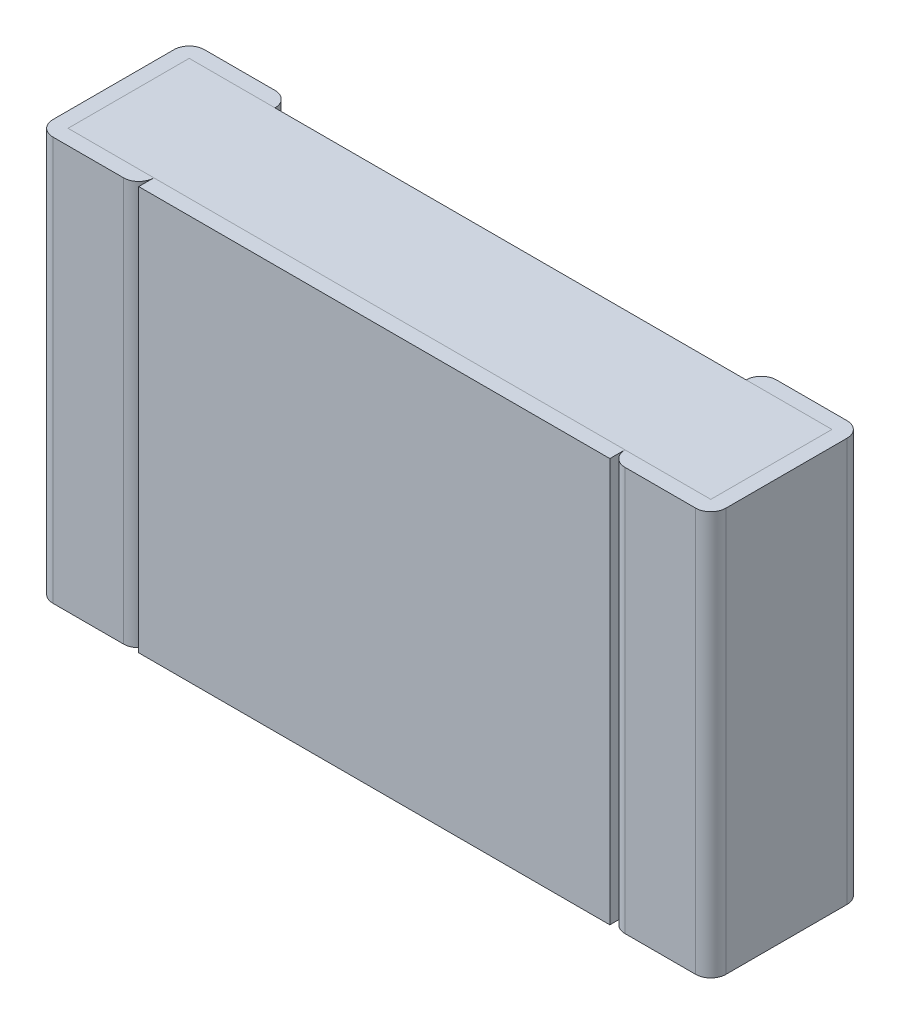
ISO-10303-21;
HEADER;
FILE_DESCRIPTION(('STEP AP214'),'2;1');
FILE_NAME('part.step','',(''),(''),'','','');
FILE_SCHEMA(('AUTOMOTIVE_DESIGN { 1 0 10303 214 1 1 1 1 }'));
ENDSEC;
DATA;
#1=APPLICATION_CONTEXT('core data for automotive mechanical design processes');
#2=APPLICATION_PROTOCOL_DEFINITION('international standard','automotive_design',2000,#1);
#3=PRODUCT_CONTEXT('',#1,'mechanical');
#4=PRODUCT('Part','Part','',(#3));
#5=PRODUCT_RELATED_PRODUCT_CATEGORY('part','',(#4));
#6=PRODUCT_DEFINITION_FORMATION('','',#4);
#7=PRODUCT_DEFINITION_CONTEXT('part definition',#1,'design');
#8=PRODUCT_DEFINITION('design','',#6,#7);
#9=PRODUCT_DEFINITION_SHAPE('','',#8);
#10=(LENGTH_UNIT() NAMED_UNIT(*) SI_UNIT(.MILLI.,.METRE.));
#11=(NAMED_UNIT(*) PLANE_ANGLE_UNIT() SI_UNIT($,.RADIAN.));
#12=(NAMED_UNIT(*) SI_UNIT($,.STERADIAN.) SOLID_ANGLE_UNIT());
#13=UNCERTAINTY_MEASURE_WITH_UNIT(LENGTH_MEASURE(1.E-05),#10,'distance_accuracy_value','');
#14=(GEOMETRIC_REPRESENTATION_CONTEXT(3) GLOBAL_UNCERTAINTY_ASSIGNED_CONTEXT((#13)) GLOBAL_UNIT_ASSIGNED_CONTEXT((#10,
#11,#12)) REPRESENTATION_CONTEXT('',''));
#15=CARTESIAN_POINT('',(0.,0.,0.));
#16=DIRECTION('',(0.,0.,1.));
#17=DIRECTION('',(1.,0.,0.));
#18=AXIS2_PLACEMENT_3D('',#15,#16,#17);
#19=CARTESIAN_POINT('',(-0.7,-0.6,0.45));
#20=DIRECTION('',(0.,0.,1.));
#21=DIRECTION('',(1.,0.,0.));
#22=AXIS2_PLACEMENT_3D('',#19,#20,#21);
#23=PLANE('',#22);
#24=DIRECTION('',(0.,1.,0.));
#25=VECTOR('',#24,1.);
#26=CARTESIAN_POINT('',(-0.7,-0.6,0.45));
#27=LINE('',#26,#25);
#28=CARTESIAN_POINT('',(-0.7,-0.6,0.45));
#29=VERTEX_POINT('',#28);
#30=CARTESIAN_POINT('',(-0.7,0.6,0.45));
#31=VERTEX_POINT('',#30);
#32=EDGE_CURVE('E374',#29,#31,#27,.T.);
#33=ORIENTED_EDGE('',*,*,#32,.F.);
#34=DIRECTION('',(1.,0.,0.));
#35=VECTOR('',#34,1.);
#36=CARTESIAN_POINT('',(-0.7,-0.6,0.45));
#37=LINE('',#36,#35);
#38=CARTESIAN_POINT('',(0.7,-0.6,0.45));
#39=VERTEX_POINT('',#38);
#40=EDGE_CURVE('E347',#29,#39,#37,.T.);
#41=ORIENTED_EDGE('',*,*,#40,.T.);
#42=DIRECTION('',(0.,1.,0.));
#43=VECTOR('',#42,1.);
#44=CARTESIAN_POINT('',(0.7,-0.6,0.45));
#45=LINE('',#44,#43);
#46=CARTESIAN_POINT('',(0.7,0.6,0.45));
#47=VERTEX_POINT('',#46);
#48=EDGE_CURVE('E11',#39,#47,#45,.T.);
#49=ORIENTED_EDGE('',*,*,#48,.T.);
#50=DIRECTION('',(1.,0.,0.));
#51=VECTOR('',#50,1.);
#52=CARTESIAN_POINT('',(-0.7,0.6,0.45));
#53=LINE('',#52,#51);
#54=EDGE_CURVE('E454',#31,#47,#53,.T.);
#55=ORIENTED_EDGE('',*,*,#54,.F.);
#56=EDGE_LOOP('',(#33,#41,#49,#55));
#57=FACE_BOUND('',#56,.T.);
#58=ADVANCED_FACE('F17',(#57),#23,.T.);
#59=CARTESIAN_POINT('',(0.7,-0.6,0.405));
#60=DIRECTION('',(1.,0.,0.));
#61=DIRECTION('',(0.,1.,0.));
#62=AXIS2_PLACEMENT_3D('',#59,#60,#61);
#63=PLANE('',#62);
#64=DIRECTION('',(0.,0.,1.));
#65=VECTOR('',#64,1.);
#66=CARTESIAN_POINT('',(0.7,-0.6,0.405));
#67=LINE('',#66,#65);
#68=CARTESIAN_POINT('',(0.7,-0.6,0.405));
#69=VERTEX_POINT('',#68);
#70=EDGE_CURVE('E236',#69,#39,#67,.T.);
#71=ORIENTED_EDGE('',*,*,#70,.F.);
#72=DIRECTION('',(0.,1.,0.));
#73=VECTOR('',#72,1.);
#74=CARTESIAN_POINT('',(0.7,-0.6,0.405));
#75=LINE('',#74,#73);
#76=CARTESIAN_POINT('',(0.7,0.6,0.405));
#77=VERTEX_POINT('',#76);
#78=EDGE_CURVE('E25',#69,#77,#75,.T.);
#79=ORIENTED_EDGE('',*,*,#78,.T.);
#80=DIRECTION('',(0.,0.,1.));
#81=VECTOR('',#80,1.);
#82=CARTESIAN_POINT('',(0.7,0.6,0.405));
#83=LINE('',#82,#81);
#84=EDGE_CURVE('E227',#77,#47,#83,.T.);
#85=ORIENTED_EDGE('',*,*,#84,.T.);
#86=ORIENTED_EDGE('',*,*,#48,.F.);
#87=EDGE_LOOP('',(#71,#79,#85,#86));
#88=FACE_BOUND('',#87,.T.);
#89=ADVANCED_FACE('F477',(#88),#63,.T.);
#90=CARTESIAN_POINT('',(0.745,-0.6,0.405));
#91=DIRECTION('',(0.,1.,0.));
#92=DIRECTION('',(-1.,0.,0.));
#93=AXIS2_PLACEMENT_3D('',#90,#91,#92);
#94=CYLINDRICAL_SURFACE('',#93,0.045);
#95=CARTESIAN_POINT('',(0.745,-0.6,0.405));
#96=DIRECTION('',(0.,1.,0.));
#97=DIRECTION('',(0.,0.,1.));
#98=AXIS2_PLACEMENT_3D('',#95,#96,#97);
#99=CIRCLE('',#98,0.045);
#100=CARTESIAN_POINT('',(0.745,-0.6,0.45));
#101=VERTEX_POINT('',#100);
#102=EDGE_CURVE('E244',#69,#101,#99,.T.);
#103=ORIENTED_EDGE('',*,*,#102,.T.);
#104=DIRECTION('',(0.,1.,0.));
#105=VECTOR('',#104,1.);
#106=CARTESIAN_POINT('',(0.745,-0.6,0.45));
#107=LINE('',#106,#105);
#108=CARTESIAN_POINT('',(0.745,0.6,0.45));
#109=VERTEX_POINT('',#108);
#110=EDGE_CURVE('E470',#101,#109,#107,.T.);
#111=ORIENTED_EDGE('',*,*,#110,.T.);
#112=CARTESIAN_POINT('',(0.745,0.6,0.405));
#113=DIRECTION('',(0.,1.,0.));
#114=DIRECTION('',(0.,0.,1.));
#115=AXIS2_PLACEMENT_3D('',#112,#113,#114);
#116=CIRCLE('',#115,0.045);
#117=EDGE_CURVE('E364',#77,#109,#116,.T.);
#118=ORIENTED_EDGE('',*,*,#117,.F.);
#119=ORIENTED_EDGE('',*,*,#78,.F.);
#120=EDGE_LOOP('',(#103,#111,#118,#119));
#121=FACE_BOUND('',#120,.T.);
#122=ADVANCED_FACE('F485',(#121),#94,.T.);
#123=CARTESIAN_POINT('',(0.7,-0.6,0.45));
#124=DIRECTION('',(0.,0.,1.));
#125=DIRECTION('',(1.,0.,0.));
#126=AXIS2_PLACEMENT_3D('',#123,#124,#125);
#127=PLANE('',#126);
#128=DIRECTION('',(1.,0.,0.));
#129=VECTOR('',#128,1.);
#130=CARTESIAN_POINT('',(0.7,0.6,0.45));
#131=LINE('',#130,#129);
#132=CARTESIAN_POINT('',(0.955,0.6,0.45));
#133=VERTEX_POINT('',#132);
#134=EDGE_CURVE('E359',#109,#133,#131,.T.);
#135=ORIENTED_EDGE('',*,*,#134,.F.);
#136=ORIENTED_EDGE('',*,*,#110,.F.);
#137=DIRECTION('',(1.,0.,0.));
#138=VECTOR('',#137,1.);
#139=CARTESIAN_POINT('',(0.7,-0.6,0.45));
#140=LINE('',#139,#138);
#141=CARTESIAN_POINT('',(0.955,-0.6,0.45));
#142=VERTEX_POINT('',#141);
#143=EDGE_CURVE('E250',#101,#142,#140,.T.);
#144=ORIENTED_EDGE('',*,*,#143,.T.);
#145=DIRECTION('',(0.,1.,0.));
#146=VECTOR('',#145,1.);
#147=CARTESIAN_POINT('',(0.955,-0.6,0.45));
#148=LINE('',#147,#146);
#149=EDGE_CURVE('E467',#142,#133,#148,.T.);
#150=ORIENTED_EDGE('',*,*,#149,.T.);
#151=EDGE_LOOP('',(#135,#136,#144,#150));
#152=FACE_BOUND('',#151,.T.);
#153=ADVANCED_FACE('F520',(#152),#127,.T.);
#154=CARTESIAN_POINT('',(0.955,-0.6,0.405));
#155=DIRECTION('',(0.,1.,0.));
#156=DIRECTION('',(1.,0.,0.));
#157=AXIS2_PLACEMENT_3D('',#154,#155,#156);
#158=CYLINDRICAL_SURFACE('',#157,0.045);
#159=DIRECTION('',(0.,1.,0.));
#160=VECTOR('',#159,1.);
#161=CARTESIAN_POINT('',(1.,-0.6,0.405));
#162=LINE('',#161,#160);
#163=CARTESIAN_POINT('',(1.,-0.6,0.405));
#164=VERTEX_POINT('',#163);
#165=CARTESIAN_POINT('',(1.,0.6,0.405));
#166=VERTEX_POINT('',#165);
#167=EDGE_CURVE('E464',#164,#166,#162,.T.);
#168=ORIENTED_EDGE('',*,*,#167,.T.);
#169=CARTESIAN_POINT('',(0.955,0.6,0.405));
#170=DIRECTION('',(0.,-1.,0.));
#171=DIRECTION('',(0.,0.,1.));
#172=AXIS2_PLACEMENT_3D('',#169,#170,#171);
#173=CIRCLE('',#172,0.045);
#174=EDGE_CURVE('E363',#166,#133,#173,.T.);
#175=ORIENTED_EDGE('',*,*,#174,.T.);
#176=ORIENTED_EDGE('',*,*,#149,.F.);
#177=CARTESIAN_POINT('',(0.955,-0.6,0.405));
#178=DIRECTION('',(0.,-1.,0.));
#179=DIRECTION('',(0.,0.,1.));
#180=AXIS2_PLACEMENT_3D('',#177,#178,#179);
#181=CIRCLE('',#180,0.045);
#182=EDGE_CURVE('E325',#164,#142,#181,.T.);
#183=ORIENTED_EDGE('',*,*,#182,.F.);
#184=EDGE_LOOP('',(#168,#175,#176,#183));
#185=FACE_BOUND('',#184,.T.);
#186=ADVANCED_FACE('F537',(#185),#158,.T.);
#187=CARTESIAN_POINT('',(1.,-0.6,0.));
#188=DIRECTION('',(1.,0.,0.));
#189=DIRECTION('',(0.,1.,0.));
#190=AXIS2_PLACEMENT_3D('',#187,#188,#189);
#191=PLANE('',#190);
#192=DIRECTION('',(0.,0.,1.));
#193=VECTOR('',#192,1.);
#194=CARTESIAN_POINT('',(1.,-0.6,0.));
#195=LINE('',#194,#193);
#196=CARTESIAN_POINT('',(1.,-0.6,0.045));
#197=VERTEX_POINT('',#196);
#198=EDGE_CURVE('E321',#197,#164,#195,.T.);
#199=ORIENTED_EDGE('',*,*,#198,.F.);
#200=DIRECTION('',(0.,1.,0.));
#201=VECTOR('',#200,1.);
#202=CARTESIAN_POINT('',(1.,-0.6,0.045));
#203=LINE('',#202,#201);
#204=CARTESIAN_POINT('',(1.,0.6,0.045));
#205=VERTEX_POINT('',#204);
#206=EDGE_CURVE('E45',#197,#205,#203,.T.);
#207=ORIENTED_EDGE('',*,*,#206,.T.);
#208=DIRECTION('',(0.,0.,1.));
#209=VECTOR('',#208,1.);
#210=CARTESIAN_POINT('',(1.,0.6,0.));
#211=LINE('',#210,#209);
#212=EDGE_CURVE('E447',#205,#166,#211,.T.);
#213=ORIENTED_EDGE('',*,*,#212,.T.);
#214=ORIENTED_EDGE('',*,*,#167,.F.);
#215=EDGE_LOOP('',(#199,#207,#213,#214));
#216=FACE_BOUND('',#215,.T.);
#217=ADVANCED_FACE('F533',(#216),#191,.T.);
#218=CARTESIAN_POINT('',(0.955,-0.6,0.045));
#219=DIRECTION('',(0.,1.,0.));
#220=DIRECTION('',(1.,0.,0.));
#221=AXIS2_PLACEMENT_3D('',#218,#219,#220);
#222=CYLINDRICAL_SURFACE('',#221,0.045);
#223=CARTESIAN_POINT('',(0.955,-0.6,0.045));
#224=DIRECTION('',(0.,1.,0.));
#225=DIRECTION('',(0.,0.,1.));
#226=AXIS2_PLACEMENT_3D('',#223,#224,#225);
#227=CIRCLE('',#226,0.045);
#228=CARTESIAN_POINT('',(0.955,-0.6,0.));
#229=VERTEX_POINT('',#228);
#230=EDGE_CURVE('E326',#197,#229,#227,.T.);
#231=ORIENTED_EDGE('',*,*,#230,.T.);
#232=DIRECTION('',(0.,1.,0.));
#233=VECTOR('',#232,1.);
#234=CARTESIAN_POINT('',(0.955,-0.6,0.));
#235=LINE('',#234,#233);
#236=CARTESIAN_POINT('',(0.955,0.6,0.));
#237=VERTEX_POINT('',#236);
#238=EDGE_CURVE('E226',#229,#237,#235,.T.);
#239=ORIENTED_EDGE('',*,*,#238,.T.);
#240=CARTESIAN_POINT('',(0.955,0.6,0.045));
#241=DIRECTION('',(0.,1.,0.));
#242=DIRECTION('',(0.,0.,1.));
#243=AXIS2_PLACEMENT_3D('',#240,#241,#242);
#244=CIRCLE('',#243,0.045);
#245=EDGE_CURVE('E450',#205,#237,#244,.T.);
#246=ORIENTED_EDGE('',*,*,#245,.F.);
#247=ORIENTED_EDGE('',*,*,#206,.F.);
#248=EDGE_LOOP('',(#231,#239,#246,#247));
#249=FACE_BOUND('',#248,.T.);
#250=ADVANCED_FACE('F530',(#249),#222,.T.);
#251=CARTESIAN_POINT('',(0.7,-0.6,0.));
#252=DIRECTION('',(0.,0.,1.));
#253=DIRECTION('',(1.,0.,0.));
#254=AXIS2_PLACEMENT_3D('',#251,#252,#253);
#255=PLANE('',#254);
#256=ORIENTED_EDGE('',*,*,#238,.F.);
#257=DIRECTION('',(1.,0.,0.));
#258=VECTOR('',#257,1.);
#259=CARTESIAN_POINT('',(0.7,-0.6,0.));
#260=LINE('',#259,#258);
#261=CARTESIAN_POINT('',(0.745,-0.6,0.));
#262=VERTEX_POINT('',#261);
#263=EDGE_CURVE('E230',#262,#229,#260,.T.);
#264=ORIENTED_EDGE('',*,*,#263,.F.);
#265=DIRECTION('',(0.,1.,0.));
#266=VECTOR('',#265,1.);
#267=CARTESIAN_POINT('',(0.745,-0.6,0.));
#268=LINE('',#267,#266);
#269=CARTESIAN_POINT('',(0.745,0.6,0.));
#270=VERTEX_POINT('',#269);
#271=EDGE_CURVE('E214',#262,#270,#268,.T.);
#272=ORIENTED_EDGE('',*,*,#271,.T.);
#273=DIRECTION('',(1.,0.,0.));
#274=VECTOR('',#273,1.);
#275=CARTESIAN_POINT('',(0.7,0.6,0.));
#276=LINE('',#275,#274);
#277=EDGE_CURVE('E373',#270,#237,#276,.T.);
#278=ORIENTED_EDGE('',*,*,#277,.T.);
#279=EDGE_LOOP('',(#256,#264,#272,#278));
#280=FACE_BOUND('',#279,.T.);
#281=ADVANCED_FACE('F231',(#280),#255,.F.);
#282=CARTESIAN_POINT('',(0.745,-0.6,0.045));
#283=DIRECTION('',(0.,1.,0.));
#284=DIRECTION('',(-1.,0.,0.));
#285=AXIS2_PLACEMENT_3D('',#282,#283,#284);
#286=CYLINDRICAL_SURFACE('',#285,0.045);
#287=DIRECTION('',(0.,1.,0.));
#288=VECTOR('',#287,1.);
#289=CARTESIAN_POINT('',(0.7,-0.6,0.045));
#290=LINE('',#289,#288);
#291=CARTESIAN_POINT('',(0.7,-0.6,0.045));
#292=VERTEX_POINT('',#291);
#293=CARTESIAN_POINT('',(0.7,0.6,0.045));
#294=VERTEX_POINT('',#293);
#295=EDGE_CURVE('E382',#292,#294,#290,.T.);
#296=ORIENTED_EDGE('',*,*,#295,.T.);
#297=CARTESIAN_POINT('',(0.745,0.6,0.045));
#298=DIRECTION('',(0.,-1.,0.));
#299=DIRECTION('',(0.,0.,1.));
#300=AXIS2_PLACEMENT_3D('',#297,#298,#299);
#301=CIRCLE('',#300,0.045);
#302=EDGE_CURVE('E221',#294,#270,#301,.T.);
#303=ORIENTED_EDGE('',*,*,#302,.T.);
#304=ORIENTED_EDGE('',*,*,#271,.F.);
#305=CARTESIAN_POINT('',(0.745,-0.6,0.045));
#306=DIRECTION('',(0.,-1.,0.));
#307=DIRECTION('',(0.,0.,1.));
#308=AXIS2_PLACEMENT_3D('',#305,#306,#307);
#309=CIRCLE('',#308,0.045);
#310=EDGE_CURVE('E219',#292,#262,#309,.T.);
#311=ORIENTED_EDGE('',*,*,#310,.F.);
#312=EDGE_LOOP('',(#296,#303,#304,#311));
#313=FACE_BOUND('',#312,.T.);
#314=ADVANCED_FACE('F217',(#313),#286,.T.);
#315=CARTESIAN_POINT('',(-0.7,0.6,0.405));
#316=DIRECTION('',(0.,1.,0.));
#317=DIRECTION('',(1.,0.,0.));
#318=AXIS2_PLACEMENT_3D('',#315,#316,#317);
#319=PLANE('',#318);
#320=DIRECTION('',(1.,0.,0.));
#321=VECTOR('',#320,1.);
#322=CARTESIAN_POINT('',(-0.7,0.6,0.405));
#323=LINE('',#322,#321);
#324=CARTESIAN_POINT('',(-0.7,0.6,0.405));
#325=VERTEX_POINT('',#324);
#326=EDGE_CURVE('E295',#325,#77,#323,.T.);
#327=ORIENTED_EDGE('',*,*,#326,.F.);
#328=DIRECTION('',(0.,0.,1.));
#329=VECTOR('',#328,1.);
#330=CARTESIAN_POINT('',(-0.7,0.6,0.405));
#331=LINE('',#330,#329);
#332=EDGE_CURVE('E369',#325,#31,#331,.T.);
#333=ORIENTED_EDGE('',*,*,#332,.T.);
#334=ORIENTED_EDGE('',*,*,#54,.T.);
#335=ORIENTED_EDGE('',*,*,#84,.F.);
#336=EDGE_LOOP('',(#327,#333,#334,#335));
#337=FACE_BOUND('',#336,.T.);
#338=ADVANCED_FACE('F483',(#337),#319,.T.);
#339=CARTESIAN_POINT('',(0.7,0.6,0.));
#340=DIRECTION('',(0.,1.,0.));
#341=DIRECTION('',(1.,0.,0.));
#342=AXIS2_PLACEMENT_3D('',#339,#340,#341);
#343=PLANE('',#342);
#344=ORIENTED_EDGE('',*,*,#277,.F.);
#345=ORIENTED_EDGE('',*,*,#302,.F.);
#346=DIRECTION('',(1.,0.,0.));
#347=VECTOR('',#346,1.);
#348=CARTESIAN_POINT('',(-0.955,0.6,0.045));
#349=LINE('',#348,#347);
#350=CARTESIAN_POINT('',(0.955,0.6,0.045));
#351=VERTEX_POINT('',#350);
#352=EDGE_CURVE('E327',#294,#351,#349,.T.);
#353=ORIENTED_EDGE('',*,*,#352,.T.);
#354=DIRECTION('',(0.,0.,1.));
#355=VECTOR('',#354,1.);
#356=CARTESIAN_POINT('',(0.955,0.6,0.045));
#357=LINE('',#356,#355);
#358=CARTESIAN_POINT('',(0.955,0.6,0.405));
#359=VERTEX_POINT('',#358);
#360=EDGE_CURVE('E294',#351,#359,#357,.T.);
#361=ORIENTED_EDGE('',*,*,#360,.T.);
#362=DIRECTION('',(1.,0.,0.));
#363=VECTOR('',#362,1.);
#364=CARTESIAN_POINT('',(-0.955,0.6,0.405));
#365=LINE('',#364,#363);
#366=EDGE_CURVE('E290',#77,#359,#365,.T.);
#367=ORIENTED_EDGE('',*,*,#366,.F.);
#368=ORIENTED_EDGE('',*,*,#117,.T.);
#369=ORIENTED_EDGE('',*,*,#134,.T.);
#370=ORIENTED_EDGE('',*,*,#174,.F.);
#371=ORIENTED_EDGE('',*,*,#212,.F.);
#372=ORIENTED_EDGE('',*,*,#245,.T.);
#373=EDGE_LOOP('',(#344,#345,#353,#361,#367,#368,#369,#370,#371,#372));
#374=FACE_BOUND('',#373,.T.);
#375=ADVANCED_FACE('F488',(#374),#343,.T.);
#376=CARTESIAN_POINT('',(-0.7,-0.6,0.405));
#377=DIRECTION('',(1.,0.,0.));
#378=DIRECTION('',(0.,1.,0.));
#379=AXIS2_PLACEMENT_3D('',#376,#377,#378);
#380=PLANE('',#379);
#381=ORIENTED_EDGE('',*,*,#32,.T.);
#382=ORIENTED_EDGE('',*,*,#332,.F.);
#383=DIRECTION('',(0.,1.,0.));
#384=VECTOR('',#383,1.);
#385=CARTESIAN_POINT('',(-0.7,-0.6,0.405));
#386=LINE('',#385,#384);
#387=CARTESIAN_POINT('',(-0.7,-0.6,0.405));
#388=VERTEX_POINT('',#387);
#389=EDGE_CURVE('E412',#388,#325,#386,.T.);
#390=ORIENTED_EDGE('',*,*,#389,.F.);
#391=DIRECTION('',(0.,0.,1.));
#392=VECTOR('',#391,1.);
#393=CARTESIAN_POINT('',(-0.7,-0.6,0.405));
#394=LINE('',#393,#392);
#395=EDGE_CURVE('E350',#388,#29,#394,.T.);
#396=ORIENTED_EDGE('',*,*,#395,.T.);
#397=EDGE_LOOP('',(#381,#382,#390,#396));
#398=FACE_BOUND('',#397,.T.);
#399=ADVANCED_FACE('F503',(#398),#380,.F.);
#400=CARTESIAN_POINT('',(-0.7,-0.6,0.405));
#401=DIRECTION('',(0.,1.,0.));
#402=DIRECTION('',(1.,0.,0.));
#403=AXIS2_PLACEMENT_3D('',#400,#401,#402);
#404=PLANE('',#403);
#405=ORIENTED_EDGE('',*,*,#70,.T.);
#406=ORIENTED_EDGE('',*,*,#40,.F.);
#407=ORIENTED_EDGE('',*,*,#395,.F.);
#408=DIRECTION('',(1.,0.,0.));
#409=VECTOR('',#408,1.);
#410=CARTESIAN_POINT('',(-0.7,-0.6,0.405));
#411=LINE('',#410,#409);
#412=EDGE_CURVE('E299',#388,#69,#411,.T.);
#413=ORIENTED_EDGE('',*,*,#412,.T.);
#414=EDGE_LOOP('',(#405,#406,#407,#413));
#415=FACE_BOUND('',#414,.T.);
#416=ADVANCED_FACE('F509',(#415),#404,.F.);
#417=CARTESIAN_POINT('',(0.7,-0.6,0.));
#418=DIRECTION('',(0.,1.,0.));
#419=DIRECTION('',(1.,0.,0.));
#420=AXIS2_PLACEMENT_3D('',#417,#418,#419);
#421=PLANE('',#420);
#422=ORIENTED_EDGE('',*,*,#230,.F.);
#423=ORIENTED_EDGE('',*,*,#198,.T.);
#424=ORIENTED_EDGE('',*,*,#182,.T.);
#425=ORIENTED_EDGE('',*,*,#143,.F.);
#426=ORIENTED_EDGE('',*,*,#102,.F.);
#427=DIRECTION('',(1.,0.,0.));
#428=VECTOR('',#427,1.);
#429=CARTESIAN_POINT('',(-0.955,-0.6,0.405));
#430=LINE('',#429,#428);
#431=CARTESIAN_POINT('',(0.955,-0.6,0.405));
#432=VERTEX_POINT('',#431);
#433=EDGE_CURVE('E304',#69,#432,#430,.T.);
#434=ORIENTED_EDGE('',*,*,#433,.T.);
#435=DIRECTION('',(0.,0.,1.));
#436=VECTOR('',#435,1.);
#437=CARTESIAN_POINT('',(0.955,-0.6,0.045));
#438=LINE('',#437,#436);
#439=CARTESIAN_POINT('',(0.955,-0.6,0.045));
#440=VERTEX_POINT('',#439);
#441=EDGE_CURVE('E339',#440,#432,#438,.T.);
#442=ORIENTED_EDGE('',*,*,#441,.F.);
#443=DIRECTION('',(1.,0.,0.));
#444=VECTOR('',#443,1.);
#445=CARTESIAN_POINT('',(-0.955,-0.6,0.045));
#446=LINE('',#445,#444);
#447=EDGE_CURVE('E241',#292,#440,#446,.T.);
#448=ORIENTED_EDGE('',*,*,#447,.F.);
#449=ORIENTED_EDGE('',*,*,#310,.T.);
#450=ORIENTED_EDGE('',*,*,#263,.T.);
#451=EDGE_LOOP('',(#422,#423,#424,#425,#426,#434,#442,#448,#449,#450));
#452=FACE_BOUND('',#451,.T.);
#453=ADVANCED_FACE('F239',(#452),#421,.F.);
#454=CARTESIAN_POINT('',(-0.955,-0.6,0.045));
#455=DIRECTION('',(0.,0.,1.));
#456=DIRECTION('',(1.,0.,0.));
#457=AXIS2_PLACEMENT_3D('',#454,#455,#456);
#458=PLANE('',#457);
#459=DIRECTION('',(1.,0.,0.));
#460=VECTOR('',#459,1.);
#461=CARTESIAN_POINT('',(-0.955,0.6,0.045));
#462=LINE('',#461,#460);
#463=CARTESIAN_POINT('',(-0.7,0.6,0.045));
#464=VERTEX_POINT('',#463);
#465=EDGE_CURVE('E330',#464,#294,#462,.T.);
#466=ORIENTED_EDGE('',*,*,#465,.T.);
#467=ORIENTED_EDGE('',*,*,#295,.F.);
#468=DIRECTION('',(1.,0.,0.));
#469=VECTOR('',#468,1.);
#470=CARTESIAN_POINT('',(-0.955,-0.6,0.045));
#471=LINE('',#470,#469);
#472=CARTESIAN_POINT('',(-0.7,-0.6,0.045));
#473=VERTEX_POINT('',#472);
#474=EDGE_CURVE('E400',#473,#292,#471,.T.);
#475=ORIENTED_EDGE('',*,*,#474,.F.);
#476=DIRECTION('',(0.,1.,0.));
#477=VECTOR('',#476,1.);
#478=CARTESIAN_POINT('',(-0.7,-0.6,0.045));
#479=LINE('',#478,#477);
#480=EDGE_CURVE('E396',#473,#464,#479,.T.);
#481=ORIENTED_EDGE('',*,*,#480,.T.);
#482=EDGE_LOOP('',(#466,#467,#475,#481));
#483=FACE_BOUND('',#482,.T.);
#484=ADVANCED_FACE('F523',(#483),#458,.F.);
#485=CARTESIAN_POINT('',(-0.955,0.6,0.045));
#486=DIRECTION('',(0.,1.,0.));
#487=DIRECTION('',(1.,0.,0.));
#488=AXIS2_PLACEMENT_3D('',#485,#486,#487);
#489=PLANE('',#488);
#490=DIRECTION('',(1.,0.,0.));
#491=VECTOR('',#490,1.);
#492=CARTESIAN_POINT('',(-0.955,0.6,0.045));
#493=LINE('',#492,#491);
#494=CARTESIAN_POINT('',(-0.955,0.6,0.045));
#495=VERTEX_POINT('',#494);
#496=EDGE_CURVE('E385',#495,#464,#493,.T.);
#497=ORIENTED_EDGE('',*,*,#496,.F.);
#498=DIRECTION('',(0.,0.,1.));
#499=VECTOR('',#498,1.);
#500=CARTESIAN_POINT('',(-0.955,0.6,0.045));
#501=LINE('',#500,#499);
#502=CARTESIAN_POINT('',(-0.955,0.6,0.405));
#503=VERTEX_POINT('',#502);
#504=EDGE_CURVE('E378',#495,#503,#501,.T.);
#505=ORIENTED_EDGE('',*,*,#504,.T.);
#506=DIRECTION('',(1.,0.,0.));
#507=VECTOR('',#506,1.);
#508=CARTESIAN_POINT('',(-0.955,0.6,0.405));
#509=LINE('',#508,#507);
#510=EDGE_CURVE('E368',#503,#325,#509,.T.);
#511=ORIENTED_EDGE('',*,*,#510,.T.);
#512=ORIENTED_EDGE('',*,*,#326,.T.);
#513=ORIENTED_EDGE('',*,*,#366,.T.);
#514=ORIENTED_EDGE('',*,*,#360,.F.);
#515=ORIENTED_EDGE('',*,*,#352,.F.);
#516=ORIENTED_EDGE('',*,*,#465,.F.);
#517=EDGE_LOOP('',(#497,#505,#511,#512,#513,#514,#515,#516));
#518=FACE_BOUND('',#517,.T.);
#519=ADVANCED_FACE('F491',(#518),#489,.T.);
#520=CARTESIAN_POINT('',(-0.745,-0.6,0.405));
#521=DIRECTION('',(0.,1.,0.));
#522=DIRECTION('',(1.,0.,0.));
#523=AXIS2_PLACEMENT_3D('',#520,#521,#522);
#524=CYLINDRICAL_SURFACE('',#523,0.045);
#525=ORIENTED_EDGE('',*,*,#389,.T.);
#526=CARTESIAN_POINT('',(-0.745,0.6,0.405));
#527=DIRECTION('',(0.,-1.,0.));
#528=DIRECTION('',(0.,0.,1.));
#529=AXIS2_PLACEMENT_3D('',#526,#527,#528);
#530=CIRCLE('',#529,0.045);
#531=CARTESIAN_POINT('',(-0.745,0.6,0.45));
#532=VERTEX_POINT('',#531);
#533=EDGE_CURVE('E358',#325,#532,#530,.T.);
#534=ORIENTED_EDGE('',*,*,#533,.T.);
#535=DIRECTION('',(0.,1.,0.));
#536=VECTOR('',#535,1.);
#537=CARTESIAN_POINT('',(-0.745,-0.6,0.45));
#538=LINE('',#537,#536);
#539=CARTESIAN_POINT('',(-0.745,-0.6,0.45));
#540=VERTEX_POINT('',#539);
#541=EDGE_CURVE('E303',#540,#532,#538,.T.);
#542=ORIENTED_EDGE('',*,*,#541,.F.);
#543=CARTESIAN_POINT('',(-0.745,-0.6,0.405));
#544=DIRECTION('',(0.,-1.,0.));
#545=DIRECTION('',(0.,0.,1.));
#546=AXIS2_PLACEMENT_3D('',#543,#544,#545);
#547=CIRCLE('',#546,0.045);
#548=EDGE_CURVE('E266',#388,#540,#547,.T.);
#549=ORIENTED_EDGE('',*,*,#548,.F.);
#550=EDGE_LOOP('',(#525,#534,#542,#549));
#551=FACE_BOUND('',#550,.T.);
#552=ADVANCED_FACE('F498',(#551),#524,.T.);
#553=CARTESIAN_POINT('',(-1.,-0.6,0.45));
#554=DIRECTION('',(0.,0.,1.));
#555=DIRECTION('',(1.,0.,0.));
#556=AXIS2_PLACEMENT_3D('',#553,#554,#555);
#557=PLANE('',#556);
#558=DIRECTION('',(1.,0.,0.));
#559=VECTOR('',#558,1.);
#560=CARTESIAN_POINT('',(-1.,0.6,0.45));
#561=LINE('',#560,#559);
#562=CARTESIAN_POINT('',(-0.955,0.6,0.45));
#563=VERTEX_POINT('',#562);
#564=EDGE_CURVE('E354',#563,#532,#561,.T.);
#565=ORIENTED_EDGE('',*,*,#564,.F.);
#566=DIRECTION('',(0.,1.,0.));
#567=VECTOR('',#566,1.);
#568=CARTESIAN_POINT('',(-0.955,-0.6,0.45));
#569=LINE('',#568,#567);
#570=CARTESIAN_POINT('',(-0.955,-0.6,0.45));
#571=VERTEX_POINT('',#570);
#572=EDGE_CURVE('E334',#571,#563,#569,.T.);
#573=ORIENTED_EDGE('',*,*,#572,.F.);
#574=DIRECTION('',(1.,0.,0.));
#575=VECTOR('',#574,1.);
#576=CARTESIAN_POINT('',(-1.,-0.6,0.45));
#577=LINE('',#576,#575);
#578=EDGE_CURVE('E261',#571,#540,#577,.T.);
#579=ORIENTED_EDGE('',*,*,#578,.T.);
#580=ORIENTED_EDGE('',*,*,#541,.T.);
#581=EDGE_LOOP('',(#565,#573,#579,#580));
#582=FACE_BOUND('',#581,.T.);
#583=ADVANCED_FACE('F571',(#582),#557,.T.);
#584=CARTESIAN_POINT('',(-0.955,-0.6,0.045));
#585=DIRECTION('',(0.,1.,0.));
#586=DIRECTION('',(1.,0.,0.));
#587=AXIS2_PLACEMENT_3D('',#584,#585,#586);
#588=PLANE('',#587);
#589=ORIENTED_EDGE('',*,*,#474,.T.);
#590=ORIENTED_EDGE('',*,*,#447,.T.);
#591=ORIENTED_EDGE('',*,*,#441,.T.);
#592=ORIENTED_EDGE('',*,*,#433,.F.);
#593=ORIENTED_EDGE('',*,*,#412,.F.);
#594=DIRECTION('',(1.,0.,0.));
#595=VECTOR('',#594,1.);
#596=CARTESIAN_POINT('',(-0.955,-0.6,0.405));
#597=LINE('',#596,#595);
#598=CARTESIAN_POINT('',(-0.955,-0.6,0.405));
#599=VERTEX_POINT('',#598);
#600=EDGE_CURVE('E285',#599,#388,#597,.T.);
#601=ORIENTED_EDGE('',*,*,#600,.F.);
#602=DIRECTION('',(0.,0.,1.));
#603=VECTOR('',#602,1.);
#604=CARTESIAN_POINT('',(-0.955,-0.6,0.045));
#605=LINE('',#604,#603);
#606=CARTESIAN_POINT('',(-0.955,-0.6,0.045));
#607=VERTEX_POINT('',#606);
#608=EDGE_CURVE('E289',#607,#599,#605,.T.);
#609=ORIENTED_EDGE('',*,*,#608,.F.);
#610=DIRECTION('',(1.,0.,0.));
#611=VECTOR('',#610,1.);
#612=CARTESIAN_POINT('',(-0.955,-0.6,0.045));
#613=LINE('',#612,#611);
#614=EDGE_CURVE('E284',#607,#473,#613,.T.);
#615=ORIENTED_EDGE('',*,*,#614,.T.);
#616=EDGE_LOOP('',(#589,#590,#591,#592,#593,#601,#609,#615));
#617=FACE_BOUND('',#616,.T.);
#618=ADVANCED_FACE('F507',(#617),#588,.F.);
#619=CARTESIAN_POINT('',(-0.745,-0.6,0.045));
#620=DIRECTION('',(0.,1.,0.));
#621=DIRECTION('',(1.,0.,0.));
#622=AXIS2_PLACEMENT_3D('',#619,#620,#621);
#623=CYLINDRICAL_SURFACE('',#622,0.045);
#624=CARTESIAN_POINT('',(-0.745,-0.6,0.045));
#625=DIRECTION('',(0.,1.,0.));
#626=DIRECTION('',(0.,0.,1.));
#627=AXIS2_PLACEMENT_3D('',#624,#625,#626);
#628=CIRCLE('',#627,0.045);
#629=CARTESIAN_POINT('',(-0.745,-0.6,0.));
#630=VERTEX_POINT('',#629);
#631=EDGE_CURVE('E274',#473,#630,#628,.T.);
#632=ORIENTED_EDGE('',*,*,#631,.T.);
#633=DIRECTION('',(0.,1.,0.));
#634=VECTOR('',#633,1.);
#635=CARTESIAN_POINT('',(-0.745,-0.6,0.));
#636=LINE('',#635,#634);
#637=CARTESIAN_POINT('',(-0.745,0.6,0.));
#638=VERTEX_POINT('',#637);
#639=EDGE_CURVE('E393',#630,#638,#636,.T.);
#640=ORIENTED_EDGE('',*,*,#639,.T.);
#641=CARTESIAN_POINT('',(-0.745,0.6,0.045));
#642=DIRECTION('',(0.,1.,0.));
#643=DIRECTION('',(0.,0.,1.));
#644=AXIS2_PLACEMENT_3D('',#641,#642,#643);
#645=CIRCLE('',#644,0.045);
#646=EDGE_CURVE('E389',#464,#638,#645,.T.);
#647=ORIENTED_EDGE('',*,*,#646,.F.);
#648=ORIENTED_EDGE('',*,*,#480,.F.);
#649=EDGE_LOOP('',(#632,#640,#647,#648));
#650=FACE_BOUND('',#649,.T.);
#651=ADVANCED_FACE('F576',(#650),#623,.T.);
#652=CARTESIAN_POINT('',(-1.,-0.6,0.));
#653=DIRECTION('',(0.,0.,1.));
#654=DIRECTION('',(1.,0.,0.));
#655=AXIS2_PLACEMENT_3D('',#652,#653,#654);
#656=PLANE('',#655);
#657=ORIENTED_EDGE('',*,*,#639,.F.);
#658=DIRECTION('',(1.,0.,0.));
#659=VECTOR('',#658,1.);
#660=CARTESIAN_POINT('',(-1.,-0.6,0.));
#661=LINE('',#660,#659);
#662=CARTESIAN_POINT('',(-0.955,-0.6,0.));
#663=VERTEX_POINT('',#662);
#664=EDGE_CURVE('E280',#663,#630,#661,.T.);
#665=ORIENTED_EDGE('',*,*,#664,.F.);
#666=DIRECTION('',(0.,1.,0.));
#667=VECTOR('',#666,1.);
#668=CARTESIAN_POINT('',(-0.955,-0.6,0.));
#669=LINE('',#668,#667);
#670=CARTESIAN_POINT('',(-0.955,0.6,0.));
#671=VERTEX_POINT('',#670);
#672=EDGE_CURVE('E279',#663,#671,#669,.T.);
#673=ORIENTED_EDGE('',*,*,#672,.T.);
#674=DIRECTION('',(1.,0.,0.));
#675=VECTOR('',#674,1.);
#676=CARTESIAN_POINT('',(-1.,0.6,0.));
#677=LINE('',#676,#675);
#678=EDGE_CURVE('E346',#671,#638,#677,.T.);
#679=ORIENTED_EDGE('',*,*,#678,.T.);
#680=EDGE_LOOP('',(#657,#665,#673,#679));
#681=FACE_BOUND('',#680,.T.);
#682=ADVANCED_FACE('F557',(#681),#656,.F.);
#683=CARTESIAN_POINT('',(-1.,0.6,0.));
#684=DIRECTION('',(0.,1.,0.));
#685=DIRECTION('',(1.,0.,0.));
#686=AXIS2_PLACEMENT_3D('',#683,#684,#685);
#687=PLANE('',#686);
#688=ORIENTED_EDGE('',*,*,#678,.F.);
#689=CARTESIAN_POINT('',(-0.955,0.6,0.045));
#690=DIRECTION('',(0.,-1.,0.));
#691=DIRECTION('',(0.,0.,1.));
#692=AXIS2_PLACEMENT_3D('',#689,#690,#691);
#693=CIRCLE('',#692,0.045);
#694=CARTESIAN_POINT('',(-1.,0.6,0.045));
#695=VERTEX_POINT('',#694);
#696=EDGE_CURVE('E275',#695,#671,#693,.T.);
#697=ORIENTED_EDGE('',*,*,#696,.F.);
#698=DIRECTION('',(0.,0.,1.));
#699=VECTOR('',#698,1.);
#700=CARTESIAN_POINT('',(-1.,0.6,0.));
#701=LINE('',#700,#699);
#702=CARTESIAN_POINT('',(-1.,0.6,0.405));
#703=VERTEX_POINT('',#702);
#704=EDGE_CURVE('E253',#695,#703,#701,.T.);
#705=ORIENTED_EDGE('',*,*,#704,.T.);
#706=CARTESIAN_POINT('',(-0.955,0.6,0.405));
#707=DIRECTION('',(0.,1.,0.));
#708=DIRECTION('',(0.,0.,1.));
#709=AXIS2_PLACEMENT_3D('',#706,#707,#708);
#710=CIRCLE('',#709,0.045);
#711=EDGE_CURVE('E338',#703,#563,#710,.T.);
#712=ORIENTED_EDGE('',*,*,#711,.T.);
#713=ORIENTED_EDGE('',*,*,#564,.T.);
#714=ORIENTED_EDGE('',*,*,#533,.F.);
#715=ORIENTED_EDGE('',*,*,#510,.F.);
#716=ORIENTED_EDGE('',*,*,#504,.F.);
#717=ORIENTED_EDGE('',*,*,#496,.T.);
#718=ORIENTED_EDGE('',*,*,#646,.T.);
#719=EDGE_LOOP('',(#688,#697,#705,#712,#713,#714,#715,#716,#717,#718));
#720=FACE_BOUND('',#719,.T.);
#721=ADVANCED_FACE('F496',(#720),#687,.T.);
#722=CARTESIAN_POINT('',(-0.955,-0.6,0.405));
#723=DIRECTION('',(0.,1.,0.));
#724=DIRECTION('',(-1.,0.,0.));
#725=AXIS2_PLACEMENT_3D('',#722,#723,#724);
#726=CYLINDRICAL_SURFACE('',#725,0.045);
#727=CARTESIAN_POINT('',(-0.955,-0.6,0.405));
#728=DIRECTION('',(0.,1.,0.));
#729=DIRECTION('',(0.,0.,1.));
#730=AXIS2_PLACEMENT_3D('',#727,#728,#729);
#731=CIRCLE('',#730,0.045);
#732=CARTESIAN_POINT('',(-1.,-0.6,0.405));
#733=VERTEX_POINT('',#732);
#734=EDGE_CURVE('E265',#733,#571,#731,.T.);
#735=ORIENTED_EDGE('',*,*,#734,.T.);
#736=ORIENTED_EDGE('',*,*,#572,.T.);
#737=ORIENTED_EDGE('',*,*,#711,.F.);
#738=DIRECTION('',(0.,1.,0.));
#739=VECTOR('',#738,1.);
#740=CARTESIAN_POINT('',(-1.,-0.6,0.405));
#741=LINE('',#740,#739);
#742=EDGE_CURVE('E257',#733,#703,#741,.T.);
#743=ORIENTED_EDGE('',*,*,#742,.F.);
#744=EDGE_LOOP('',(#735,#736,#737,#743));
#745=FACE_BOUND('',#744,.T.);
#746=ADVANCED_FACE('F568',(#745),#726,.T.);
#747=CARTESIAN_POINT('',(-0.955,-0.6,0.045));
#748=DIRECTION('',(0.,1.,0.));
#749=DIRECTION('',(-1.,0.,0.));
#750=AXIS2_PLACEMENT_3D('',#747,#748,#749);
#751=CYLINDRICAL_SURFACE('',#750,0.045);
#752=DIRECTION('',(0.,1.,0.));
#753=VECTOR('',#752,1.);
#754=CARTESIAN_POINT('',(-1.,-0.6,0.045));
#755=LINE('',#754,#753);
#756=CARTESIAN_POINT('',(-1.,-0.6,0.045));
#757=VERTEX_POINT('',#756);
#758=EDGE_CURVE('E256',#757,#695,#755,.T.);
#759=ORIENTED_EDGE('',*,*,#758,.T.);
#760=ORIENTED_EDGE('',*,*,#696,.T.);
#761=ORIENTED_EDGE('',*,*,#672,.F.);
#762=CARTESIAN_POINT('',(-0.955,-0.6,0.045));
#763=DIRECTION('',(0.,-1.,0.));
#764=DIRECTION('',(0.,0.,1.));
#765=AXIS2_PLACEMENT_3D('',#762,#763,#764);
#766=CIRCLE('',#765,0.045);
#767=EDGE_CURVE('E314',#757,#663,#766,.T.);
#768=ORIENTED_EDGE('',*,*,#767,.F.);
#769=EDGE_LOOP('',(#759,#760,#761,#768));
#770=FACE_BOUND('',#769,.T.);
#771=ADVANCED_FACE('F560',(#770),#751,.T.);
#772=CARTESIAN_POINT('',(-1.,-0.6,0.));
#773=DIRECTION('',(0.,1.,0.));
#774=DIRECTION('',(1.,0.,0.));
#775=AXIS2_PLACEMENT_3D('',#772,#773,#774);
#776=PLANE('',#775);
#777=ORIENTED_EDGE('',*,*,#631,.F.);
#778=ORIENTED_EDGE('',*,*,#614,.F.);
#779=ORIENTED_EDGE('',*,*,#608,.T.);
#780=ORIENTED_EDGE('',*,*,#600,.T.);
#781=ORIENTED_EDGE('',*,*,#548,.T.);
#782=ORIENTED_EDGE('',*,*,#578,.F.);
#783=ORIENTED_EDGE('',*,*,#734,.F.);
#784=DIRECTION('',(0.,0.,1.));
#785=VECTOR('',#784,1.);
#786=CARTESIAN_POINT('',(-1.,-0.6,0.));
#787=LINE('',#786,#785);
#788=EDGE_CURVE('E270',#757,#733,#787,.T.);
#789=ORIENTED_EDGE('',*,*,#788,.F.);
#790=ORIENTED_EDGE('',*,*,#767,.T.);
#791=ORIENTED_EDGE('',*,*,#664,.T.);
#792=EDGE_LOOP('',(#777,#778,#779,#780,#781,#782,#783,#789,#790,#791));
#793=FACE_BOUND('',#792,.T.);
#794=ADVANCED_FACE('F574',(#793),#776,.F.);
#795=CARTESIAN_POINT('',(-1.,-0.6,0.));
#796=DIRECTION('',(1.,0.,0.));
#797=DIRECTION('',(0.,1.,0.));
#798=AXIS2_PLACEMENT_3D('',#795,#796,#797);
#799=PLANE('',#798);
#800=ORIENTED_EDGE('',*,*,#742,.T.);
#801=ORIENTED_EDGE('',*,*,#704,.F.);
#802=ORIENTED_EDGE('',*,*,#758,.F.);
#803=ORIENTED_EDGE('',*,*,#788,.T.);
#804=EDGE_LOOP('',(#800,#801,#802,#803));
#805=FACE_BOUND('',#804,.T.);
#806=ADVANCED_FACE('F565',(#805),#799,.F.);
#807=CLOSED_SHELL('',(#58,#89,#122,#153,#186,#217,#250,#281,#314,#338,#375,#399,#416,#453,#484,
#519,#552,#583,#618,#651,#682,#721,#746,#771,#794,#806));
#808=MANIFOLD_SOLID_BREP('B1',#807);
#809=ADVANCED_BREP_SHAPE_REPRESENTATION('',(#18,#808),#14);
#810=SHAPE_DEFINITION_REPRESENTATION(#9,#809);
ENDSEC;
END-ISO-10303-21;
